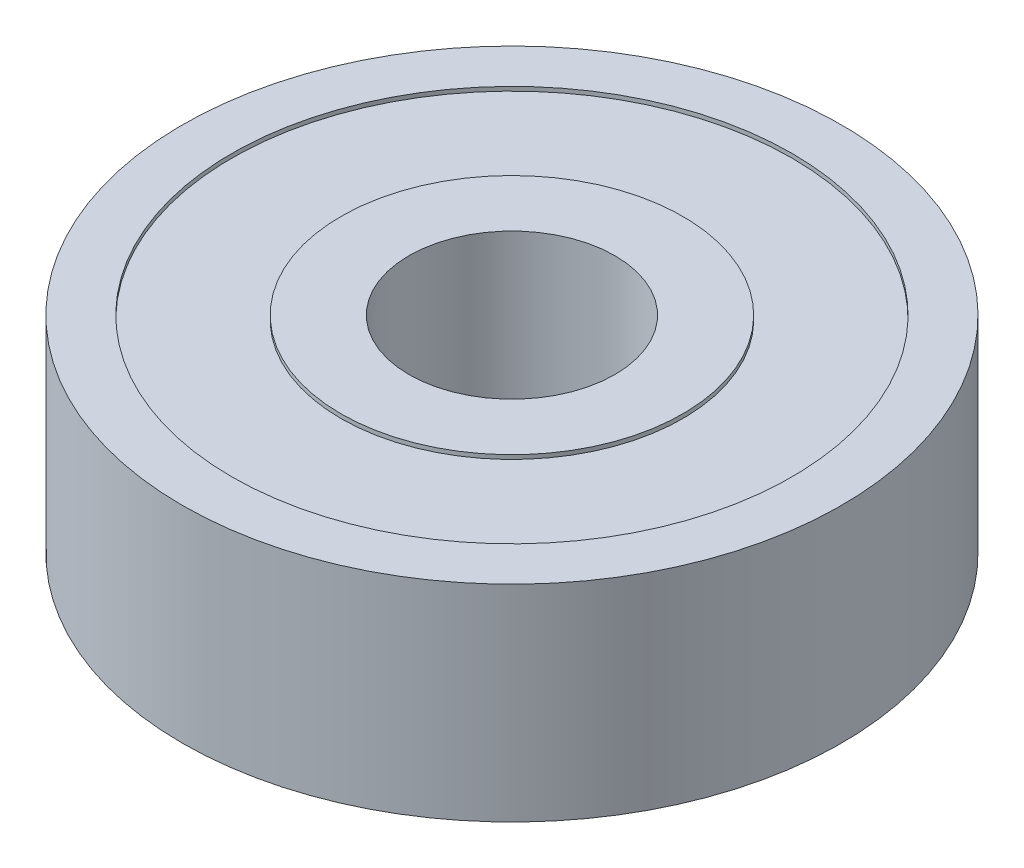
ISO-10303-21;
HEADER;
FILE_DESCRIPTION(('STEP AP214'),'2;1');
FILE_NAME('part.step','',(''),(''),'','','');
FILE_SCHEMA(('AUTOMOTIVE_DESIGN { 1 0 10303 214 1 1 1 1 }'));
ENDSEC;
DATA;
#1=APPLICATION_CONTEXT('core data for automotive mechanical design processes');
#2=APPLICATION_PROTOCOL_DEFINITION('international standard','automotive_design',2000,#1);
#3=PRODUCT_CONTEXT('',#1,'mechanical');
#4=PRODUCT('Part','Part','',(#3));
#5=PRODUCT_RELATED_PRODUCT_CATEGORY('part','',(#4));
#6=PRODUCT_DEFINITION_FORMATION('','',#4);
#7=PRODUCT_DEFINITION_CONTEXT('part definition',#1,'design');
#8=PRODUCT_DEFINITION('design','',#6,#7);
#9=PRODUCT_DEFINITION_SHAPE('','',#8);
#10=(LENGTH_UNIT() NAMED_UNIT(*) SI_UNIT(.MILLI.,.METRE.));
#11=(NAMED_UNIT(*) PLANE_ANGLE_UNIT() SI_UNIT($,.RADIAN.));
#12=(NAMED_UNIT(*) SI_UNIT($,.STERADIAN.) SOLID_ANGLE_UNIT());
#13=UNCERTAINTY_MEASURE_WITH_UNIT(LENGTH_MEASURE(1.E-05),#10,'distance_accuracy_value','');
#14=(GEOMETRIC_REPRESENTATION_CONTEXT(3) GLOBAL_UNCERTAINTY_ASSIGNED_CONTEXT((#13)) GLOBAL_UNIT_ASSIGNED_CONTEXT((#10,
#11,#12)) REPRESENTATION_CONTEXT('',''));
#15=CARTESIAN_POINT('',(0.,0.,0.));
#16=DIRECTION('',(0.,0.,1.));
#17=DIRECTION('',(1.,0.,0.));
#18=AXIS2_PLACEMENT_3D('',#15,#16,#17);
#19=CARTESIAN_POINT('',(0.,0.,0.));
#20=DIRECTION('',(0.,1.,0.));
#21=DIRECTION('',(0.,0.,1.));
#22=AXIS2_PLACEMENT_3D('',#19,#20,#21);
#23=PLANE('',#22);
#24=CARTESIAN_POINT('',(0.,0.,0.));
#25=DIRECTION('',(0.,1.,0.));
#26=DIRECTION('',(0.,0.,1.));
#27=AXIS2_PLACEMENT_3D('',#24,#25,#26);
#28=CIRCLE('',#27,2.5);
#29=CARTESIAN_POINT('',(0.,0.,2.5));
#30=VERTEX_POINT('',#29);
#31=EDGE_CURVE('E46',#30,#30,#28,.T.);
#32=ORIENTED_EDGE('',*,*,#31,.T.);
#33=EDGE_LOOP('',(#32));
#34=FACE_BOUND('',#33,.T.);
#35=CARTESIAN_POINT('',(0.,0.,0.));
#36=DIRECTION('',(0.,-1.,0.));
#37=DIRECTION('',(0.,0.,-1.));
#38=AXIS2_PLACEMENT_3D('',#35,#36,#37);
#39=CIRCLE('',#38,4.15);
#40=CARTESIAN_POINT('',(0.,0.,-4.15));
#41=VERTEX_POINT('',#40);
#42=EDGE_CURVE('E70',#41,#41,#39,.T.);
#43=ORIENTED_EDGE('',*,*,#42,.T.);
#44=EDGE_LOOP('',(#43));
#45=FACE_BOUND('',#44,.T.);
#46=ADVANCED_FACE('F33',(#34,#45),#23,.F.);
#47=CARTESIAN_POINT('',(0.,5.,0.));
#48=DIRECTION('',(0.,1.,0.));
#49=DIRECTION('',(0.,0.,1.));
#50=AXIS2_PLACEMENT_3D('',#47,#48,#49);
#51=PLANE('',#50);
#52=CARTESIAN_POINT('',(0.,5.,0.));
#53=DIRECTION('',(0.,1.,0.));
#54=DIRECTION('',(0.,0.,1.));
#55=AXIS2_PLACEMENT_3D('',#52,#53,#54);
#56=CIRCLE('',#55,2.5);
#57=CARTESIAN_POINT('',(0.,5.,2.5));
#58=VERTEX_POINT('',#57);
#59=EDGE_CURVE('E44',#58,#58,#56,.T.);
#60=ORIENTED_EDGE('',*,*,#59,.F.);
#61=EDGE_LOOP('',(#60));
#62=FACE_BOUND('',#61,.T.);
#63=CARTESIAN_POINT('',(0.,5.,0.));
#64=DIRECTION('',(0.,1.,0.));
#65=DIRECTION('',(0.,0.,1.));
#66=AXIS2_PLACEMENT_3D('',#63,#64,#65);
#67=CIRCLE('',#66,4.15);
#68=CARTESIAN_POINT('',(0.,5.,4.15));
#69=VERTEX_POINT('',#68);
#70=EDGE_CURVE('E58',#69,#69,#67,.T.);
#71=ORIENTED_EDGE('',*,*,#70,.T.);
#72=EDGE_LOOP('',(#71));
#73=FACE_BOUND('',#72,.T.);
#74=ADVANCED_FACE('F108',(#62,#73),#51,.T.);
#75=CARTESIAN_POINT('',(0.,5.,0.));
#76=DIRECTION('',(0.,1.,0.));
#77=DIRECTION('',(0.,0.,1.));
#78=AXIS2_PLACEMENT_3D('',#75,#76,#77);
#79=CIRCLE('',#78,6.8);
#80=CARTESIAN_POINT('',(0.,5.,6.8));
#81=VERTEX_POINT('',#80);
#82=EDGE_CURVE('E52',#81,#81,#79,.T.);
#83=ORIENTED_EDGE('',*,*,#82,.F.);
#84=EDGE_LOOP('',(#83));
#85=FACE_BOUND('',#84,.T.);
#86=CARTESIAN_POINT('',(0.,5.,0.));
#87=DIRECTION('',(0.,1.,0.));
#88=DIRECTION('',(0.,0.,1.));
#89=AXIS2_PLACEMENT_3D('',#86,#87,#88);
#90=CIRCLE('',#89,8.);
#91=CARTESIAN_POINT('',(0.,5.,8.));
#92=VERTEX_POINT('',#91);
#93=EDGE_CURVE('E10',#92,#92,#90,.T.);
#94=ORIENTED_EDGE('',*,*,#93,.T.);
#95=EDGE_LOOP('',(#94));
#96=FACE_BOUND('',#95,.T.);
#97=ADVANCED_FACE('F95',(#85,#96),#51,.T.);
#98=CARTESIAN_POINT('',(0.,0.,0.));
#99=DIRECTION('',(0.,-1.,0.));
#100=DIRECTION('',(0.,0.,-1.));
#101=AXIS2_PLACEMENT_3D('',#98,#99,#100);
#102=CIRCLE('',#101,6.8);
#103=CARTESIAN_POINT('',(0.,0.,-6.8));
#104=VERTEX_POINT('',#103);
#105=EDGE_CURVE('E64',#104,#104,#102,.T.);
#106=ORIENTED_EDGE('',*,*,#105,.F.);
#107=EDGE_LOOP('',(#106));
#108=FACE_BOUND('',#107,.T.);
#109=CARTESIAN_POINT('',(0.,0.,0.));
#110=DIRECTION('',(0.,1.,0.));
#111=DIRECTION('',(0.,0.,1.));
#112=AXIS2_PLACEMENT_3D('',#109,#110,#111);
#113=CIRCLE('',#112,8.);
#114=CARTESIAN_POINT('',(0.,0.,8.));
#115=VERTEX_POINT('',#114);
#116=EDGE_CURVE('E37',#115,#115,#113,.T.);
#117=ORIENTED_EDGE('',*,*,#116,.F.);
#118=EDGE_LOOP('',(#117));
#119=FACE_BOUND('',#118,.T.);
#120=ADVANCED_FACE('F92',(#108,#119),#23,.F.);
#121=CARTESIAN_POINT('',(0.,5.,0.));
#122=DIRECTION('',(0.,-1.,0.));
#123=DIRECTION('',(0.,0.,-1.));
#124=AXIS2_PLACEMENT_3D('',#121,#122,#123);
#125=CYLINDRICAL_SURFACE('',#124,8.);
#126=ORIENTED_EDGE('',*,*,#93,.F.);
#127=EDGE_LOOP('',(#126));
#128=FACE_BOUND('',#127,.T.);
#129=ORIENTED_EDGE('',*,*,#116,.T.);
#130=EDGE_LOOP('',(#129));
#131=FACE_BOUND('',#130,.T.);
#132=ADVANCED_FACE('F35',(#128,#131),#125,.T.);
#133=CARTESIAN_POINT('',(0.,5.,0.));
#134=DIRECTION('',(0.,-1.,0.));
#135=DIRECTION('',(0.,0.,-1.));
#136=AXIS2_PLACEMENT_3D('',#133,#134,#135);
#137=CYLINDRICAL_SURFACE('',#136,2.5);
#138=ORIENTED_EDGE('',*,*,#59,.T.);
#139=EDGE_LOOP('',(#138));
#140=FACE_BOUND('',#139,.T.);
#141=ORIENTED_EDGE('',*,*,#31,.F.);
#142=EDGE_LOOP('',(#141));
#143=FACE_BOUND('',#142,.T.);
#144=ADVANCED_FACE('F99',(#140,#143),#137,.F.);
#145=CARTESIAN_POINT('',(0.,4.9,0.));
#146=DIRECTION('',(0.,1.,0.));
#147=DIRECTION('',(0.,0.,1.));
#148=AXIS2_PLACEMENT_3D('',#145,#146,#147);
#149=CYLINDRICAL_SURFACE('',#148,6.8);
#150=CARTESIAN_POINT('',(0.,4.9,0.));
#151=DIRECTION('',(0.,1.,0.));
#152=DIRECTION('',(0.,0.,1.));
#153=AXIS2_PLACEMENT_3D('',#150,#151,#152);
#154=CIRCLE('',#153,6.8);
#155=CARTESIAN_POINT('',(0.,4.9,6.8));
#156=VERTEX_POINT('',#155);
#157=EDGE_CURVE('E49',#156,#156,#154,.T.);
#158=ORIENTED_EDGE('',*,*,#157,.F.);
#159=EDGE_LOOP('',(#158));
#160=FACE_BOUND('',#159,.T.);
#161=ORIENTED_EDGE('',*,*,#82,.T.);
#162=EDGE_LOOP('',(#161));
#163=FACE_BOUND('',#162,.T.);
#164=ADVANCED_FACE('F104',(#160,#163),#149,.F.);
#165=CARTESIAN_POINT('',(0.,4.9,0.));
#166=DIRECTION('',(0.,1.,0.));
#167=DIRECTION('',(0.,0.,1.));
#168=AXIS2_PLACEMENT_3D('',#165,#166,#167);
#169=PLANE('',#168);
#170=CARTESIAN_POINT('',(0.,4.9,0.));
#171=DIRECTION('',(0.,1.,0.));
#172=DIRECTION('',(0.,0.,1.));
#173=AXIS2_PLACEMENT_3D('',#170,#171,#172);
#174=CIRCLE('',#173,4.15);
#175=CARTESIAN_POINT('',(0.,4.9,4.15));
#176=VERTEX_POINT('',#175);
#177=EDGE_CURVE('E55',#176,#176,#174,.T.);
#178=ORIENTED_EDGE('',*,*,#177,.F.);
#179=EDGE_LOOP('',(#178));
#180=FACE_BOUND('',#179,.T.);
#181=ORIENTED_EDGE('',*,*,#157,.T.);
#182=EDGE_LOOP('',(#181));
#183=FACE_BOUND('',#182,.T.);
#184=ADVANCED_FACE('F121',(#180,#183),#169,.T.);
#185=CARTESIAN_POINT('',(0.,4.9,0.));
#186=DIRECTION('',(0.,1.,0.));
#187=DIRECTION('',(0.,0.,1.));
#188=AXIS2_PLACEMENT_3D('',#185,#186,#187);
#189=CYLINDRICAL_SURFACE('',#188,4.15);
#190=ORIENTED_EDGE('',*,*,#177,.T.);
#191=EDGE_LOOP('',(#190));
#192=FACE_BOUND('',#191,.T.);
#193=ORIENTED_EDGE('',*,*,#70,.F.);
#194=EDGE_LOOP('',(#193));
#195=FACE_BOUND('',#194,.T.);
#196=ADVANCED_FACE('F88',(#192,#195),#189,.T.);
#197=CARTESIAN_POINT('',(0.,0.1,0.));
#198=DIRECTION('',(0.,-1.,0.));
#199=DIRECTION('',(0.,0.,-1.));
#200=AXIS2_PLACEMENT_3D('',#197,#198,#199);
#201=CYLINDRICAL_SURFACE('',#200,6.8);
#202=CARTESIAN_POINT('',(0.,0.1,0.));
#203=DIRECTION('',(0.,-1.,0.));
#204=DIRECTION('',(0.,0.,-1.));
#205=AXIS2_PLACEMENT_3D('',#202,#203,#204);
#206=CIRCLE('',#205,6.8);
#207=CARTESIAN_POINT('',(0.,0.1,-6.8));
#208=VERTEX_POINT('',#207);
#209=EDGE_CURVE('E61',#208,#208,#206,.T.);
#210=ORIENTED_EDGE('',*,*,#209,.F.);
#211=EDGE_LOOP('',(#210));
#212=FACE_BOUND('',#211,.T.);
#213=ORIENTED_EDGE('',*,*,#105,.T.);
#214=EDGE_LOOP('',(#213));
#215=FACE_BOUND('',#214,.T.);
#216=ADVANCED_FACE('F82',(#212,#215),#201,.F.);
#217=CARTESIAN_POINT('',(0.,0.1,0.));
#218=DIRECTION('',(0.,-1.,0.));
#219=DIRECTION('',(0.,0.,-1.));
#220=AXIS2_PLACEMENT_3D('',#217,#218,#219);
#221=PLANE('',#220);
#222=CARTESIAN_POINT('',(0.,0.1,0.));
#223=DIRECTION('',(0.,-1.,0.));
#224=DIRECTION('',(0.,0.,-1.));
#225=AXIS2_PLACEMENT_3D('',#222,#223,#224);
#226=CIRCLE('',#225,4.15);
#227=CARTESIAN_POINT('',(0.,0.1,-4.15));
#228=VERTEX_POINT('',#227);
#229=EDGE_CURVE('E67',#228,#228,#226,.T.);
#230=ORIENTED_EDGE('',*,*,#229,.F.);
#231=EDGE_LOOP('',(#230));
#232=FACE_BOUND('',#231,.T.);
#233=ORIENTED_EDGE('',*,*,#209,.T.);
#234=EDGE_LOOP('',(#233));
#235=FACE_BOUND('',#234,.T.);
#236=ADVANCED_FACE('F79',(#232,#235),#221,.T.);
#237=CARTESIAN_POINT('',(0.,0.1,0.));
#238=DIRECTION('',(0.,-1.,0.));
#239=DIRECTION('',(0.,0.,-1.));
#240=AXIS2_PLACEMENT_3D('',#237,#238,#239);
#241=CYLINDRICAL_SURFACE('',#240,4.15);
#242=ORIENTED_EDGE('',*,*,#229,.T.);
#243=EDGE_LOOP('',(#242));
#244=FACE_BOUND('',#243,.T.);
#245=ORIENTED_EDGE('',*,*,#42,.F.);
#246=EDGE_LOOP('',(#245));
#247=FACE_BOUND('',#246,.T.);
#248=ADVANCED_FACE('F76',(#244,#247),#241,.T.);
#249=CLOSED_SHELL('',(#46,#74,#97,#120,#132,#144,#164,#184,#196,#216,#236,#248));
#250=MANIFOLD_SOLID_BREP('B2',#249);
#251=ADVANCED_BREP_SHAPE_REPRESENTATION('',(#18,#250),#14);
#252=SHAPE_DEFINITION_REPRESENTATION(#9,#251);
ENDSEC;
END-ISO-10303-21;
